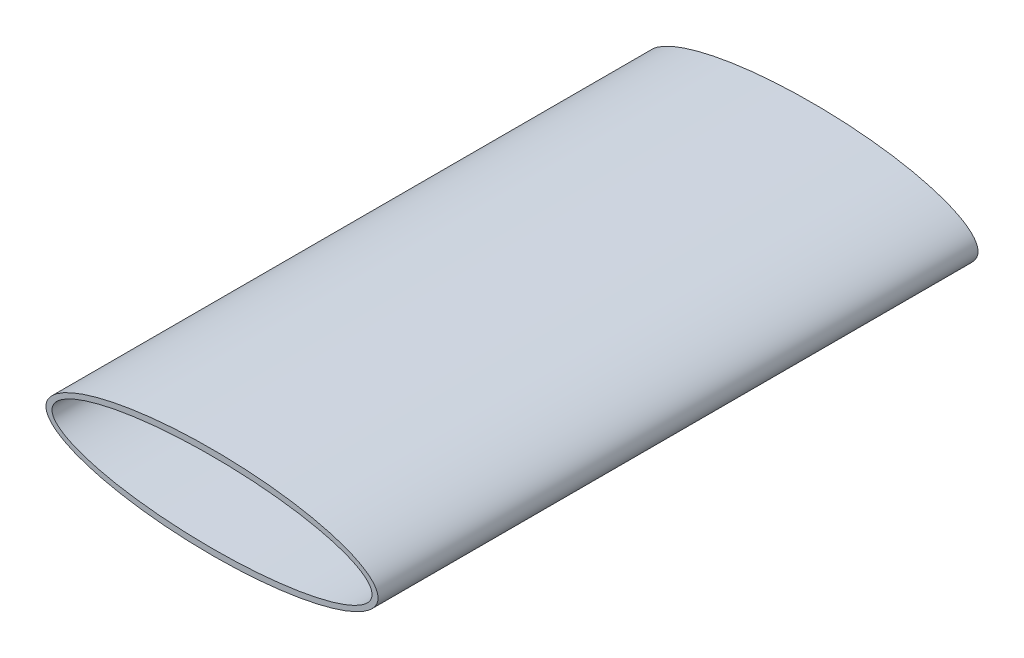
ISO-10303-21;
HEADER;
FILE_DESCRIPTION(('STEP AP214'),'2;1');
FILE_NAME('part.step','',(''),(''),'','','');
FILE_SCHEMA(('AUTOMOTIVE_DESIGN { 1 0 10303 214 1 1 1 1 }'));
ENDSEC;
DATA;
#1=APPLICATION_CONTEXT('core data for automotive mechanical design processes');
#2=APPLICATION_PROTOCOL_DEFINITION('international standard','automotive_design',2000,#1);
#3=PRODUCT_CONTEXT('',#1,'mechanical');
#4=PRODUCT('Part','Part','',(#3));
#5=PRODUCT_RELATED_PRODUCT_CATEGORY('part','',(#4));
#6=PRODUCT_DEFINITION_FORMATION('','',#4);
#7=PRODUCT_DEFINITION_CONTEXT('part definition',#1,'design');
#8=PRODUCT_DEFINITION('design','',#6,#7);
#9=PRODUCT_DEFINITION_SHAPE('','',#8);
#10=(LENGTH_UNIT() NAMED_UNIT(*) SI_UNIT(.MILLI.,.METRE.));
#11=(NAMED_UNIT(*) PLANE_ANGLE_UNIT() SI_UNIT($,.RADIAN.));
#12=(NAMED_UNIT(*) SI_UNIT($,.STERADIAN.) SOLID_ANGLE_UNIT());
#13=UNCERTAINTY_MEASURE_WITH_UNIT(LENGTH_MEASURE(1.E-05),#10,'distance_accuracy_value','');
#14=(GEOMETRIC_REPRESENTATION_CONTEXT(3) GLOBAL_UNCERTAINTY_ASSIGNED_CONTEXT((#13)) GLOBAL_UNIT_ASSIGNED_CONTEXT((#10,
#11,#12)) REPRESENTATION_CONTEXT('',''));
#15=CARTESIAN_POINT('',(0.,0.,0.));
#16=DIRECTION('',(0.,0.,1.));
#17=DIRECTION('',(1.,0.,0.));
#18=AXIS2_PLACEMENT_3D('',#15,#16,#17);
#19=CARTESIAN_POINT('',(1000.,400.,-3000.));
#20=DIRECTION('',(0.,0.,1.));
#21=DIRECTION('',(-1.,0.,0.));
#22=AXIS2_PLACEMENT_3D('',#19,#20,#21);
#23=ELLIPSE('',#22,830.,230.);
#24=DIRECTION('',(0.,0.,1.));
#25=VECTOR('',#24,1.);
#26=SURFACE_OF_LINEAR_EXTRUSION('',#23,#25);
#27=CARTESIAN_POINT('',(170.,400.,-3000.));
#28=VERTEX_POINT('',#27);
#29=EDGE_CURVE('E10',#28,#28,#23,.T.);
#30=ORIENTED_EDGE('',*,*,#29,.T.);
#31=EDGE_LOOP('',(#30));
#32=FACE_BOUND('',#31,.T.);
#33=CARTESIAN_POINT('',(1000.,400.,0.));
#34=DIRECTION('',(0.,0.,1.));
#35=DIRECTION('',(-1.,0.,0.));
#36=AXIS2_PLACEMENT_3D('',#33,#34,#35);
#37=ELLIPSE('',#36,830.,230.);
#38=CARTESIAN_POINT('',(170.,400.,0.));
#39=VERTEX_POINT('',#38);
#40=EDGE_CURVE('E31',#39,#39,#37,.T.);
#41=ORIENTED_EDGE('',*,*,#40,.F.);
#42=EDGE_LOOP('',(#41));
#43=FACE_BOUND('',#42,.T.);
#44=ADVANCED_FACE('F24',(#32,#43),#26,.T.);
#45=CARTESIAN_POINT('',(1000.,400.,-3000.));
#46=DIRECTION('',(0.,0.,1.));
#47=DIRECTION('',(1.,0.,0.));
#48=AXIS2_PLACEMENT_3D('',#45,#46,#47);
#49=PLANE('',#48);
#50=CARTESIAN_POINT('',(1000.,400.,-3000.));
#51=DIRECTION('',(0.,0.,1.));
#52=DIRECTION('',(-1.,0.,0.));
#53=AXIS2_PLACEMENT_3D('',#50,#51,#52);
#54=ELLIPSE('',#53,800.,200.);
#55=CARTESIAN_POINT('',(200.,400.,-3000.));
#56=VERTEX_POINT('',#55);
#57=EDGE_CURVE('E35',#56,#56,#54,.T.);
#58=ORIENTED_EDGE('',*,*,#57,.T.);
#59=EDGE_LOOP('',(#58));
#60=FACE_BOUND('',#59,.T.);
#61=ORIENTED_EDGE('',*,*,#29,.F.);
#62=EDGE_LOOP('',(#61));
#63=FACE_BOUND('',#62,.T.);
#64=ADVANCED_FACE('F50',(#60,#63),#49,.F.);
#65=CARTESIAN_POINT('',(1000.,400.,0.));
#66=DIRECTION('',(0.,0.,1.));
#67=DIRECTION('',(1.,0.,0.));
#68=AXIS2_PLACEMENT_3D('',#65,#66,#67);
#69=PLANE('',#68);
#70=CARTESIAN_POINT('',(1000.,400.,0.));
#71=DIRECTION('',(0.,0.,1.));
#72=DIRECTION('',(-1.,0.,0.));
#73=AXIS2_PLACEMENT_3D('',#70,#71,#72);
#74=ELLIPSE('',#73,800.,200.);
#75=CARTESIAN_POINT('',(200.,400.,0.));
#76=VERTEX_POINT('',#75);
#77=EDGE_CURVE('E39',#76,#76,#74,.T.);
#78=ORIENTED_EDGE('',*,*,#77,.F.);
#79=EDGE_LOOP('',(#78));
#80=FACE_BOUND('',#79,.T.);
#81=ORIENTED_EDGE('',*,*,#40,.T.);
#82=EDGE_LOOP('',(#81));
#83=FACE_BOUND('',#82,.T.);
#84=ADVANCED_FACE('F47',(#80,#83),#69,.T.);
#85=DIRECTION('',(0.,0.,1.));
#86=VECTOR('',#85,1.);
#87=SURFACE_OF_LINEAR_EXTRUSION('',#54,#86);
#88=ORIENTED_EDGE('',*,*,#57,.F.);
#89=EDGE_LOOP('',(#88));
#90=FACE_BOUND('',#89,.T.);
#91=ORIENTED_EDGE('',*,*,#77,.T.);
#92=EDGE_LOOP('',(#91));
#93=FACE_BOUND('',#92,.T.);
#94=ADVANCED_FACE('F44',(#90,#93),#87,.F.);
#95=CLOSED_SHELL('',(#44,#64,#84,#94));
#96=MANIFOLD_SOLID_BREP('B2',#95);
#97=ADVANCED_BREP_SHAPE_REPRESENTATION('',(#18,#96),#14);
#98=SHAPE_DEFINITION_REPRESENTATION(#9,#97);
ENDSEC;
END-ISO-10303-21;
